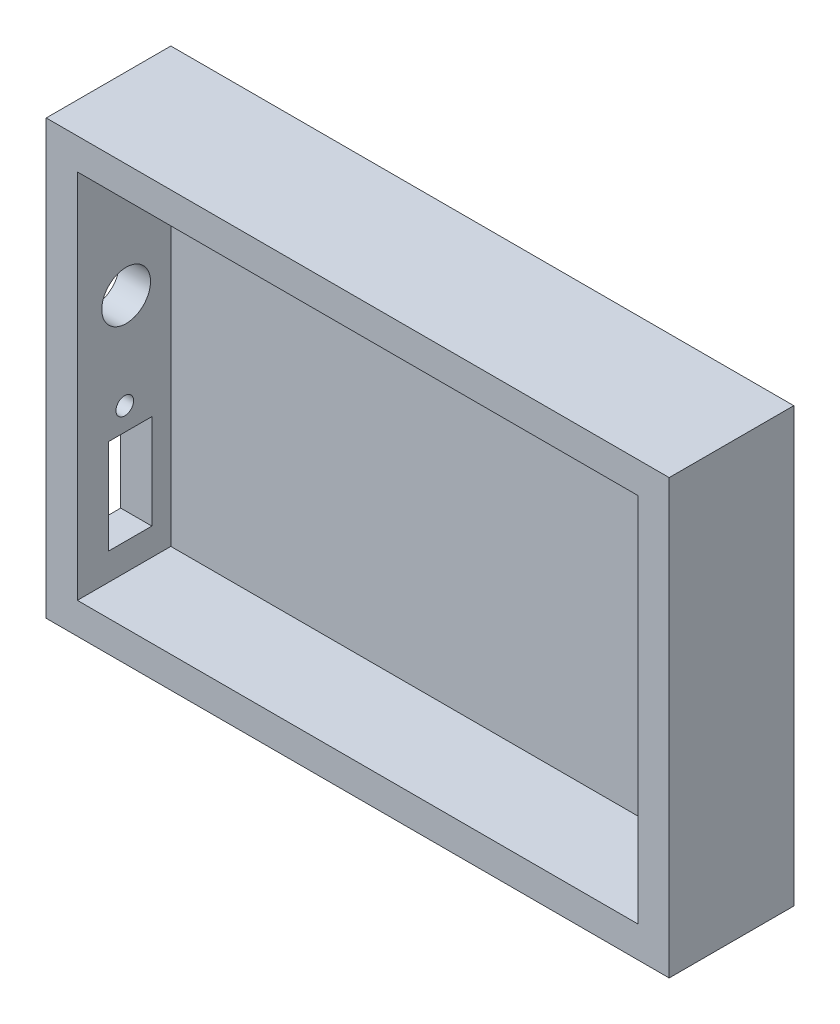
ISO-10303-21;
HEADER;
FILE_DESCRIPTION(('STEP AP214'),'2;1');
FILE_NAME('part.step','',(''),(''),'','','');
FILE_SCHEMA(('AUTOMOTIVE_DESIGN { 1 0 10303 214 1 1 1 1 }'));
ENDSEC;
DATA;
#1=APPLICATION_CONTEXT('core data for automotive mechanical design processes');
#2=APPLICATION_PROTOCOL_DEFINITION('international standard','automotive_design',2000,#1);
#3=PRODUCT_CONTEXT('',#1,'mechanical');
#4=PRODUCT('Part','Part','',(#3));
#5=PRODUCT_RELATED_PRODUCT_CATEGORY('part','',(#4));
#6=PRODUCT_DEFINITION_FORMATION('','',#4);
#7=PRODUCT_DEFINITION_CONTEXT('part definition',#1,'design');
#8=PRODUCT_DEFINITION('design','',#6,#7);
#9=PRODUCT_DEFINITION_SHAPE('','',#8);
#10=(LENGTH_UNIT() NAMED_UNIT(*) SI_UNIT(.MILLI.,.METRE.));
#11=(NAMED_UNIT(*) PLANE_ANGLE_UNIT() SI_UNIT($,.RADIAN.));
#12=(NAMED_UNIT(*) SI_UNIT($,.STERADIAN.) SOLID_ANGLE_UNIT());
#13=UNCERTAINTY_MEASURE_WITH_UNIT(LENGTH_MEASURE(1.E-05),#10,'distance_accuracy_value','');
#14=(GEOMETRIC_REPRESENTATION_CONTEXT(3) GLOBAL_UNCERTAINTY_ASSIGNED_CONTEXT((#13)) GLOBAL_UNIT_ASSIGNED_CONTEXT((#10,
#11,#12)) REPRESENTATION_CONTEXT('',''));
#15=CARTESIAN_POINT('',(0.,0.,0.));
#16=DIRECTION('',(0.,0.,1.));
#17=DIRECTION('',(1.,0.,0.));
#18=AXIS2_PLACEMENT_3D('',#15,#16,#17);
#19=CARTESIAN_POINT('',(115.,80.,46.));
#20=DIRECTION('',(-1.,0.,0.));
#21=DIRECTION('',(0.,-1.,0.));
#22=AXIS2_PLACEMENT_3D('',#19,#20,#21);
#23=PLANE('',#22);
#24=DIRECTION('',(0.,1.,0.));
#25=VECTOR('',#24,1.);
#26=CARTESIAN_POINT('',(115.,80.,0.));
#27=LINE('',#26,#25);
#28=CARTESIAN_POINT('',(115.,-80.,0.));
#29=VERTEX_POINT('',#28);
#30=CARTESIAN_POINT('',(115.,80.,0.));
#31=VERTEX_POINT('',#30);
#32=EDGE_CURVE('E165',#29,#31,#27,.T.);
#33=ORIENTED_EDGE('',*,*,#32,.T.);
#34=DIRECTION('',(0.,0.,-1.));
#35=VECTOR('',#34,1.);
#36=CARTESIAN_POINT('',(115.,80.,46.));
#37=LINE('',#36,#35);
#38=CARTESIAN_POINT('',(115.,80.,46.));
#39=VERTEX_POINT('',#38);
#40=EDGE_CURVE('E11',#39,#31,#37,.T.);
#41=ORIENTED_EDGE('',*,*,#40,.F.);
#42=DIRECTION('',(0.,1.,0.));
#43=VECTOR('',#42,1.);
#44=CARTESIAN_POINT('',(115.,80.,46.));
#45=LINE('',#44,#43);
#46=CARTESIAN_POINT('',(115.,-80.,46.));
#47=VERTEX_POINT('',#46);
#48=EDGE_CURVE('E189',#47,#39,#45,.T.);
#49=ORIENTED_EDGE('',*,*,#48,.F.);
#50=DIRECTION('',(0.,0.,-1.));
#51=VECTOR('',#50,1.);
#52=CARTESIAN_POINT('',(115.,-80.,46.));
#53=LINE('',#52,#51);
#54=EDGE_CURVE('E199',#47,#29,#53,.T.);
#55=ORIENTED_EDGE('',*,*,#54,.T.);
#56=EDGE_LOOP('',(#33,#41,#49,#55));
#57=FACE_BOUND('',#56,.T.);
#58=ADVANCED_FACE('F33',(#57),#23,.F.);
#59=CARTESIAN_POINT('',(-115.,80.,46.));
#60=DIRECTION('',(0.,-1.,0.));
#61=DIRECTION('',(0.,0.,-1.));
#62=AXIS2_PLACEMENT_3D('',#59,#60,#61);
#63=PLANE('',#62);
#64=DIRECTION('',(-1.,0.,0.));
#65=VECTOR('',#64,1.);
#66=CARTESIAN_POINT('',(-115.,80.,0.));
#67=LINE('',#66,#65);
#68=CARTESIAN_POINT('',(-115.,80.,0.));
#69=VERTEX_POINT('',#68);
#70=EDGE_CURVE('E202',#31,#69,#67,.T.);
#71=ORIENTED_EDGE('',*,*,#70,.T.);
#72=DIRECTION('',(0.,0.,-1.));
#73=VECTOR('',#72,1.);
#74=CARTESIAN_POINT('',(-115.,80.,46.));
#75=LINE('',#74,#73);
#76=CARTESIAN_POINT('',(-115.,80.,46.));
#77=VERTEX_POINT('',#76);
#78=EDGE_CURVE('E40',#77,#69,#75,.T.);
#79=ORIENTED_EDGE('',*,*,#78,.F.);
#80=DIRECTION('',(-1.,0.,0.));
#81=VECTOR('',#80,1.);
#82=CARTESIAN_POINT('',(-115.,80.,46.));
#83=LINE('',#82,#81);
#84=EDGE_CURVE('E192',#39,#77,#83,.T.);
#85=ORIENTED_EDGE('',*,*,#84,.F.);
#86=ORIENTED_EDGE('',*,*,#40,.T.);
#87=EDGE_LOOP('',(#71,#79,#85,#86));
#88=FACE_BOUND('',#87,.T.);
#89=ADVANCED_FACE('F232',(#88),#63,.F.);
#90=CARTESIAN_POINT('',(-115.,80.,46.));
#91=DIRECTION('',(1.,0.,0.));
#92=DIRECTION('',(0.,1.,0.));
#93=AXIS2_PLACEMENT_3D('',#90,#91,#92);
#94=PLANE('',#93);
#95=CARTESIAN_POINT('',(-115.,-15.,28.5));
#96=DIRECTION('',(-1.,0.,0.));
#97=DIRECTION('',(0.,-1.,0.));
#98=AXIS2_PLACEMENT_3D('',#95,#96,#97);
#99=CIRCLE('',#98,3.25);
#100=CARTESIAN_POINT('',(-115.,-18.25,28.5));
#101=VERTEX_POINT('',#100);
#102=EDGE_CURVE('E289',#101,#101,#99,.T.);
#103=ORIENTED_EDGE('',*,*,#102,.F.);
#104=EDGE_LOOP('',(#103));
#105=FACE_BOUND('',#104,.T.);
#106=CARTESIAN_POINT('',(-115.,20.,28.));
#107=DIRECTION('',(-1.,0.,0.));
#108=DIRECTION('',(0.,-1.,0.));
#109=AXIS2_PLACEMENT_3D('',#106,#107,#108);
#110=CIRCLE('',#109,9.00000000000001);
#111=CARTESIAN_POINT('',(-115.,11.,28.));
#112=VERTEX_POINT('',#111);
#113=EDGE_CURVE('E297',#112,#112,#110,.T.);
#114=ORIENTED_EDGE('',*,*,#113,.F.);
#115=EDGE_LOOP('',(#114));
#116=FACE_BOUND('',#115,.T.);
#117=DIRECTION('',(0.,1.,0.));
#118=VECTOR('',#117,1.);
#119=CARTESIAN_POINT('',(-115.,-23.5,34.5));
#120=LINE('',#119,#118);
#121=CARTESIAN_POINT('',(-115.,-58.5,34.5));
#122=VERTEX_POINT('',#121);
#123=CARTESIAN_POINT('',(-115.,-23.5,34.5));
#124=VERTEX_POINT('',#123);
#125=EDGE_CURVE('E145',#122,#124,#120,.T.);
#126=ORIENTED_EDGE('',*,*,#125,.F.);
#127=DIRECTION('',(0.,0.,1.));
#128=VECTOR('',#127,1.);
#129=CARTESIAN_POINT('',(-115.,-58.5,34.5));
#130=LINE('',#129,#128);
#131=CARTESIAN_POINT('',(-115.,-58.5,18.5));
#132=VERTEX_POINT('',#131);
#133=EDGE_CURVE('E138',#132,#122,#130,.T.);
#134=ORIENTED_EDGE('',*,*,#133,.F.);
#135=DIRECTION('',(0.,-1.,0.));
#136=VECTOR('',#135,1.);
#137=CARTESIAN_POINT('',(-115.,-23.5,18.5));
#138=LINE('',#137,#136);
#139=CARTESIAN_POINT('',(-115.,-23.5,18.5));
#140=VERTEX_POINT('',#139);
#141=EDGE_CURVE('E149',#140,#132,#138,.T.);
#142=ORIENTED_EDGE('',*,*,#141,.F.);
#143=DIRECTION('',(0.,0.,-1.));
#144=VECTOR('',#143,1.);
#145=CARTESIAN_POINT('',(-115.,-23.5,34.5));
#146=LINE('',#145,#144);
#147=EDGE_CURVE('E47',#124,#140,#146,.T.);
#148=ORIENTED_EDGE('',*,*,#147,.F.);
#149=EDGE_LOOP('',(#126,#134,#142,#148));
#150=FACE_BOUND('',#149,.T.);
#151=DIRECTION('',(0.,-1.,0.));
#152=VECTOR('',#151,1.);
#153=CARTESIAN_POINT('',(-115.,80.,0.));
#154=LINE('',#153,#152);
#155=CARTESIAN_POINT('',(-115.,-80.,0.));
#156=VERTEX_POINT('',#155);
#157=EDGE_CURVE('E204',#69,#156,#154,.T.);
#158=ORIENTED_EDGE('',*,*,#157,.T.);
#159=DIRECTION('',(0.,0.,-1.));
#160=VECTOR('',#159,1.);
#161=CARTESIAN_POINT('',(-115.,-80.,46.));
#162=LINE('',#161,#160);
#163=CARTESIAN_POINT('',(-115.,-80.,46.));
#164=VERTEX_POINT('',#163);
#165=EDGE_CURVE('E209',#164,#156,#162,.T.);
#166=ORIENTED_EDGE('',*,*,#165,.F.);
#167=DIRECTION('',(0.,-1.,0.));
#168=VECTOR('',#167,1.);
#169=CARTESIAN_POINT('',(-115.,80.,46.));
#170=LINE('',#169,#168);
#171=EDGE_CURVE('E195',#77,#164,#170,.T.);
#172=ORIENTED_EDGE('',*,*,#171,.F.);
#173=ORIENTED_EDGE('',*,*,#78,.T.);
#174=EDGE_LOOP('',(#158,#166,#172,#173));
#175=FACE_BOUND('',#174,.T.);
#176=ADVANCED_FACE('F216',(#105,#116,#150,#175),#94,.F.);
#177=CARTESIAN_POINT('',(-115.,-80.,46.));
#178=DIRECTION('',(0.,1.,0.));
#179=DIRECTION('',(0.,0.,1.));
#180=AXIS2_PLACEMENT_3D('',#177,#178,#179);
#181=PLANE('',#180);
#182=DIRECTION('',(1.,0.,0.));
#183=VECTOR('',#182,1.);
#184=CARTESIAN_POINT('',(-115.,-80.,0.));
#185=LINE('',#184,#183);
#186=EDGE_CURVE('E193',#156,#29,#185,.T.);
#187=ORIENTED_EDGE('',*,*,#186,.T.);
#188=ORIENTED_EDGE('',*,*,#54,.F.);
#189=DIRECTION('',(1.,0.,0.));
#190=VECTOR('',#189,1.);
#191=CARTESIAN_POINT('',(-115.,-80.,46.));
#192=LINE('',#191,#190);
#193=EDGE_CURVE('E197',#164,#47,#192,.T.);
#194=ORIENTED_EDGE('',*,*,#193,.F.);
#195=ORIENTED_EDGE('',*,*,#165,.T.);
#196=EDGE_LOOP('',(#187,#188,#194,#195));
#197=FACE_BOUND('',#196,.T.);
#198=ADVANCED_FACE('F225',(#197),#181,.F.);
#199=CARTESIAN_POINT('',(0.,0.,46.));
#200=DIRECTION('',(0.,0.,1.));
#201=DIRECTION('',(1.,0.,0.));
#202=AXIS2_PLACEMENT_3D('',#199,#200,#201);
#203=PLANE('',#202);
#204=DIRECTION('',(0.,1.,0.));
#205=VECTOR('',#204,1.);
#206=CARTESIAN_POINT('',(103.5,80.,46.));
#207=LINE('',#206,#205);
#208=CARTESIAN_POINT('',(103.5,-68.5,46.));
#209=VERTEX_POINT('',#208);
#210=CARTESIAN_POINT('',(103.5,68.5,46.));
#211=VERTEX_POINT('',#210);
#212=EDGE_CURVE('E181',#209,#211,#207,.T.);
#213=ORIENTED_EDGE('',*,*,#212,.F.);
#214=DIRECTION('',(1.,0.,0.));
#215=VECTOR('',#214,1.);
#216=CARTESIAN_POINT('',(-115.,-68.5,46.));
#217=LINE('',#216,#215);
#218=CARTESIAN_POINT('',(-103.5,-68.5,46.));
#219=VERTEX_POINT('',#218);
#220=EDGE_CURVE('E171',#219,#209,#217,.T.);
#221=ORIENTED_EDGE('',*,*,#220,.F.);
#222=DIRECTION('',(0.,-1.,0.));
#223=VECTOR('',#222,1.);
#224=CARTESIAN_POINT('',(-103.5,80.,46.));
#225=LINE('',#224,#223);
#226=CARTESIAN_POINT('',(-103.5,68.5,46.));
#227=VERTEX_POINT('',#226);
#228=EDGE_CURVE('E185',#227,#219,#225,.T.);
#229=ORIENTED_EDGE('',*,*,#228,.F.);
#230=DIRECTION('',(-1.,0.,0.));
#231=VECTOR('',#230,1.);
#232=CARTESIAN_POINT('',(-115.,68.5,46.));
#233=LINE('',#232,#231);
#234=EDGE_CURVE('E183',#211,#227,#233,.T.);
#235=ORIENTED_EDGE('',*,*,#234,.F.);
#236=EDGE_LOOP('',(#213,#221,#229,#235));
#237=FACE_BOUND('',#236,.T.);
#238=ORIENTED_EDGE('',*,*,#48,.T.);
#239=ORIENTED_EDGE('',*,*,#84,.T.);
#240=ORIENTED_EDGE('',*,*,#171,.T.);
#241=ORIENTED_EDGE('',*,*,#193,.T.);
#242=EDGE_LOOP('',(#238,#239,#240,#241));
#243=FACE_BOUND('',#242,.T.);
#244=ADVANCED_FACE('F231',(#237,#243),#203,.T.);
#245=CARTESIAN_POINT('',(0.,0.,0.));
#246=DIRECTION('',(0.,0.,1.));
#247=DIRECTION('',(1.,0.,0.));
#248=AXIS2_PLACEMENT_3D('',#245,#246,#247);
#249=PLANE('',#248);
#250=ORIENTED_EDGE('',*,*,#32,.F.);
#251=ORIENTED_EDGE('',*,*,#186,.F.);
#252=ORIENTED_EDGE('',*,*,#157,.F.);
#253=ORIENTED_EDGE('',*,*,#70,.F.);
#254=EDGE_LOOP('',(#250,#251,#252,#253));
#255=FACE_BOUND('',#254,.T.);
#256=ADVANCED_FACE('F222',(#255),#249,.F.);
#257=CARTESIAN_POINT('',(103.5,80.,46.));
#258=DIRECTION('',(-1.,0.,0.));
#259=DIRECTION('',(0.,-1.,0.));
#260=AXIS2_PLACEMENT_3D('',#257,#258,#259);
#261=PLANE('',#260);
#262=DIRECTION('',(0.,1.,0.));
#263=VECTOR('',#262,1.);
#264=CARTESIAN_POINT('',(103.5,80.,11.5));
#265=LINE('',#264,#263);
#266=CARTESIAN_POINT('',(103.5,-68.5,11.5));
#267=VERTEX_POINT('',#266);
#268=CARTESIAN_POINT('',(103.5,68.5,11.5));
#269=VERTEX_POINT('',#268);
#270=EDGE_CURVE('E158',#267,#269,#265,.T.);
#271=ORIENTED_EDGE('',*,*,#270,.F.);
#272=DIRECTION('',(0.,0.,-1.));
#273=VECTOR('',#272,1.);
#274=CARTESIAN_POINT('',(103.5,-68.5,46.));
#275=LINE('',#274,#273);
#276=EDGE_CURVE('E167',#209,#267,#275,.T.);
#277=ORIENTED_EDGE('',*,*,#276,.F.);
#278=ORIENTED_EDGE('',*,*,#212,.T.);
#279=DIRECTION('',(0.,0.,-1.));
#280=VECTOR('',#279,1.);
#281=CARTESIAN_POINT('',(103.5,68.5,46.));
#282=LINE('',#281,#280);
#283=EDGE_CURVE('E162',#211,#269,#282,.T.);
#284=ORIENTED_EDGE('',*,*,#283,.T.);
#285=EDGE_LOOP('',(#271,#277,#278,#284));
#286=FACE_BOUND('',#285,.T.);
#287=ADVANCED_FACE('F245',(#286),#261,.T.);
#288=CARTESIAN_POINT('',(-115.,68.5,46.));
#289=DIRECTION('',(0.,-1.,0.));
#290=DIRECTION('',(0.,0.,-1.));
#291=AXIS2_PLACEMENT_3D('',#288,#289,#290);
#292=PLANE('',#291);
#293=DIRECTION('',(-1.,0.,0.));
#294=VECTOR('',#293,1.);
#295=CARTESIAN_POINT('',(-115.,68.5,11.5));
#296=LINE('',#295,#294);
#297=CARTESIAN_POINT('',(-103.5,68.5,11.5));
#298=VERTEX_POINT('',#297);
#299=EDGE_CURVE('E161',#269,#298,#296,.T.);
#300=ORIENTED_EDGE('',*,*,#299,.F.);
#301=ORIENTED_EDGE('',*,*,#283,.F.);
#302=ORIENTED_EDGE('',*,*,#234,.T.);
#303=DIRECTION('',(0.,0.,-1.));
#304=VECTOR('',#303,1.);
#305=CARTESIAN_POINT('',(-103.5,68.5,46.));
#306=LINE('',#305,#304);
#307=EDGE_CURVE('E166',#227,#298,#306,.T.);
#308=ORIENTED_EDGE('',*,*,#307,.T.);
#309=EDGE_LOOP('',(#300,#301,#302,#308));
#310=FACE_BOUND('',#309,.T.);
#311=ADVANCED_FACE('F259',(#310),#292,.T.);
#312=CARTESIAN_POINT('',(-103.5,80.,46.));
#313=DIRECTION('',(1.,0.,0.));
#314=DIRECTION('',(0.,1.,0.));
#315=AXIS2_PLACEMENT_3D('',#312,#313,#314);
#316=PLANE('',#315);
#317=CARTESIAN_POINT('',(-103.5,-15.,28.5));
#318=DIRECTION('',(1.,0.,0.));
#319=DIRECTION('',(0.,1.,0.));
#320=AXIS2_PLACEMENT_3D('',#317,#318,#319);
#321=CIRCLE('',#320,3.25);
#322=CARTESIAN_POINT('',(-103.5,-11.75,28.5));
#323=VERTEX_POINT('',#322);
#324=EDGE_CURVE('E292',#323,#323,#321,.F.);
#325=ORIENTED_EDGE('',*,*,#324,.T.);
#326=EDGE_LOOP('',(#325));
#327=FACE_BOUND('',#326,.T.);
#328=CARTESIAN_POINT('',(-103.5,20.,28.));
#329=DIRECTION('',(1.,0.,0.));
#330=DIRECTION('',(0.,1.,0.));
#331=AXIS2_PLACEMENT_3D('',#328,#329,#330);
#332=CIRCLE('',#331,9.00000000000001);
#333=CARTESIAN_POINT('',(-103.5,29.,28.));
#334=VERTEX_POINT('',#333);
#335=EDGE_CURVE('E294',#334,#334,#332,.F.);
#336=ORIENTED_EDGE('',*,*,#335,.T.);
#337=EDGE_LOOP('',(#336));
#338=FACE_BOUND('',#337,.T.);
#339=DIRECTION('',(0.,0.,1.));
#340=VECTOR('',#339,1.);
#341=CARTESIAN_POINT('',(-103.5,-58.5,34.5));
#342=LINE('',#341,#340);
#343=CARTESIAN_POINT('',(-103.5,-58.5,18.5));
#344=VERTEX_POINT('',#343);
#345=CARTESIAN_POINT('',(-103.5,-58.5,34.5));
#346=VERTEX_POINT('',#345);
#347=EDGE_CURVE('E135',#344,#346,#342,.T.);
#348=ORIENTED_EDGE('',*,*,#347,.T.);
#349=DIRECTION('',(0.,1.,0.));
#350=VECTOR('',#349,1.);
#351=CARTESIAN_POINT('',(-103.5,-23.5,34.5));
#352=LINE('',#351,#350);
#353=CARTESIAN_POINT('',(-103.5,-23.5,34.5));
#354=VERTEX_POINT('',#353);
#355=EDGE_CURVE('E122',#346,#354,#352,.T.);
#356=ORIENTED_EDGE('',*,*,#355,.T.);
#357=DIRECTION('',(0.,0.,-1.));
#358=VECTOR('',#357,1.);
#359=CARTESIAN_POINT('',(-103.5,-23.5,34.5));
#360=LINE('',#359,#358);
#361=CARTESIAN_POINT('',(-103.5,-23.5,18.5));
#362=VERTEX_POINT('',#361);
#363=EDGE_CURVE('E153',#354,#362,#360,.T.);
#364=ORIENTED_EDGE('',*,*,#363,.T.);
#365=DIRECTION('',(0.,-1.,0.));
#366=VECTOR('',#365,1.);
#367=CARTESIAN_POINT('',(-103.5,-23.5,18.5));
#368=LINE('',#367,#366);
#369=EDGE_CURVE('E143',#362,#344,#368,.T.);
#370=ORIENTED_EDGE('',*,*,#369,.T.);
#371=EDGE_LOOP('',(#348,#356,#364,#370));
#372=FACE_BOUND('',#371,.T.);
#373=DIRECTION('',(0.,-1.,0.));
#374=VECTOR('',#373,1.);
#375=CARTESIAN_POINT('',(-103.5,80.,11.5));
#376=LINE('',#375,#374);
#377=CARTESIAN_POINT('',(-103.5,-68.5,11.5));
#378=VERTEX_POINT('',#377);
#379=EDGE_CURVE('E173',#298,#378,#376,.T.);
#380=ORIENTED_EDGE('',*,*,#379,.F.);
#381=ORIENTED_EDGE('',*,*,#307,.F.);
#382=ORIENTED_EDGE('',*,*,#228,.T.);
#383=DIRECTION('',(0.,0.,-1.));
#384=VECTOR('',#383,1.);
#385=CARTESIAN_POINT('',(-103.5,-68.5,46.));
#386=LINE('',#385,#384);
#387=EDGE_CURVE('E170',#219,#378,#386,.T.);
#388=ORIENTED_EDGE('',*,*,#387,.T.);
#389=EDGE_LOOP('',(#380,#381,#382,#388));
#390=FACE_BOUND('',#389,.T.);
#391=ADVANCED_FACE('F141',(#327,#338,#372,#390),#316,.T.);
#392=CARTESIAN_POINT('',(-115.,-68.5,46.));
#393=DIRECTION('',(0.,1.,0.));
#394=DIRECTION('',(0.,0.,1.));
#395=AXIS2_PLACEMENT_3D('',#392,#393,#394);
#396=PLANE('',#395);
#397=DIRECTION('',(1.,0.,0.));
#398=VECTOR('',#397,1.);
#399=CARTESIAN_POINT('',(-115.,-68.5,11.5));
#400=LINE('',#399,#398);
#401=EDGE_CURVE('E177',#378,#267,#400,.T.);
#402=ORIENTED_EDGE('',*,*,#401,.F.);
#403=ORIENTED_EDGE('',*,*,#387,.F.);
#404=ORIENTED_EDGE('',*,*,#220,.T.);
#405=ORIENTED_EDGE('',*,*,#276,.T.);
#406=EDGE_LOOP('',(#402,#403,#404,#405));
#407=FACE_BOUND('',#406,.T.);
#408=ADVANCED_FACE('F252',(#407),#396,.T.);
#409=CARTESIAN_POINT('',(0.,0.,11.5));
#410=DIRECTION('',(0.,0.,1.));
#411=DIRECTION('',(1.,0.,0.));
#412=AXIS2_PLACEMENT_3D('',#409,#410,#411);
#413=PLANE('',#412);
#414=ORIENTED_EDGE('',*,*,#270,.T.);
#415=ORIENTED_EDGE('',*,*,#299,.T.);
#416=ORIENTED_EDGE('',*,*,#379,.T.);
#417=ORIENTED_EDGE('',*,*,#401,.T.);
#418=EDGE_LOOP('',(#414,#415,#416,#417));
#419=FACE_BOUND('',#418,.T.);
#420=ADVANCED_FACE('F249',(#419),#413,.T.);
#421=CARTESIAN_POINT('',(-65.0162371902123,-58.5,34.5));
#422=DIRECTION('',(0.,-1.,0.));
#423=DIRECTION('',(0.,0.,-1.));
#424=AXIS2_PLACEMENT_3D('',#421,#422,#423);
#425=PLANE('',#424);
#426=DIRECTION('',(-1.,0.,0.));
#427=VECTOR('',#426,1.);
#428=CARTESIAN_POINT('',(-65.0162371902123,-58.5,18.5));
#429=LINE('',#428,#427);
#430=EDGE_CURVE('E55',#344,#132,#429,.T.);
#431=ORIENTED_EDGE('',*,*,#430,.T.);
#432=ORIENTED_EDGE('',*,*,#133,.T.);
#433=DIRECTION('',(-1.,0.,0.));
#434=VECTOR('',#433,1.);
#435=CARTESIAN_POINT('',(-65.0162371902123,-58.5,34.5));
#436=LINE('',#435,#434);
#437=EDGE_CURVE('E126',#346,#122,#436,.T.);
#438=ORIENTED_EDGE('',*,*,#437,.F.);
#439=ORIENTED_EDGE('',*,*,#347,.F.);
#440=EDGE_LOOP('',(#431,#432,#438,#439));
#441=FACE_BOUND('',#440,.T.);
#442=ADVANCED_FACE('F134',(#441),#425,.F.);
#443=CARTESIAN_POINT('',(-65.0162371902123,-23.5,34.5));
#444=DIRECTION('',(0.,0.,1.));
#445=DIRECTION('',(0.,-1.,0.));
#446=AXIS2_PLACEMENT_3D('',#443,#444,#445);
#447=PLANE('',#446);
#448=ORIENTED_EDGE('',*,*,#437,.T.);
#449=ORIENTED_EDGE('',*,*,#125,.T.);
#450=DIRECTION('',(-1.,0.,0.));
#451=VECTOR('',#450,1.);
#452=CARTESIAN_POINT('',(-65.0162371902123,-23.5,34.5));
#453=LINE('',#452,#451);
#454=EDGE_CURVE('E128',#354,#124,#453,.T.);
#455=ORIENTED_EDGE('',*,*,#454,.F.);
#456=ORIENTED_EDGE('',*,*,#355,.F.);
#457=EDGE_LOOP('',(#448,#449,#455,#456));
#458=FACE_BOUND('',#457,.T.);
#459=ADVANCED_FACE('F124',(#458),#447,.F.);
#460=CARTESIAN_POINT('',(-65.0162371902123,-23.5,34.5));
#461=DIRECTION('',(0.,1.,0.));
#462=DIRECTION('',(0.,0.,1.));
#463=AXIS2_PLACEMENT_3D('',#460,#461,#462);
#464=PLANE('',#463);
#465=ORIENTED_EDGE('',*,*,#454,.T.);
#466=ORIENTED_EDGE('',*,*,#147,.T.);
#467=DIRECTION('',(-1.,0.,0.));
#468=VECTOR('',#467,1.);
#469=CARTESIAN_POINT('',(-65.0162371902123,-23.5,18.5));
#470=LINE('',#469,#468);
#471=EDGE_CURVE('E152',#362,#140,#470,.T.);
#472=ORIENTED_EDGE('',*,*,#471,.F.);
#473=ORIENTED_EDGE('',*,*,#363,.F.);
#474=EDGE_LOOP('',(#465,#466,#472,#473));
#475=FACE_BOUND('',#474,.T.);
#476=ADVANCED_FACE('F271',(#475),#464,.F.);
#477=CARTESIAN_POINT('',(-65.0162371902123,-23.5,18.5));
#478=DIRECTION('',(0.,0.,-1.));
#479=DIRECTION('',(0.,1.,0.));
#480=AXIS2_PLACEMENT_3D('',#477,#478,#479);
#481=PLANE('',#480);
#482=ORIENTED_EDGE('',*,*,#471,.T.);
#483=ORIENTED_EDGE('',*,*,#141,.T.);
#484=ORIENTED_EDGE('',*,*,#430,.F.);
#485=ORIENTED_EDGE('',*,*,#369,.F.);
#486=EDGE_LOOP('',(#482,#483,#484,#485));
#487=FACE_BOUND('',#486,.T.);
#488=ADVANCED_FACE('F274',(#487),#481,.F.);
#489=CARTESIAN_POINT('',(-65.0162371902123,20.,28.));
#490=DIRECTION('',(-1.,0.,0.));
#491=DIRECTION('',(0.,-1.,0.));
#492=AXIS2_PLACEMENT_3D('',#489,#490,#491);
#493=CYLINDRICAL_SURFACE('',#492,9.00000000000001);
#494=ORIENTED_EDGE('',*,*,#113,.T.);
#495=EDGE_LOOP('',(#494));
#496=FACE_BOUND('',#495,.T.);
#497=ORIENTED_EDGE('',*,*,#335,.F.);
#498=EDGE_LOOP('',(#497));
#499=FACE_BOUND('',#498,.T.);
#500=ADVANCED_FACE('F277',(#496,#499),#493,.F.);
#501=CARTESIAN_POINT('',(-65.0162371902123,-15.,28.5));
#502=DIRECTION('',(-1.,0.,0.));
#503=DIRECTION('',(0.,-1.,0.));
#504=AXIS2_PLACEMENT_3D('',#501,#502,#503);
#505=CYLINDRICAL_SURFACE('',#504,3.25);
#506=ORIENTED_EDGE('',*,*,#102,.T.);
#507=EDGE_LOOP('',(#506));
#508=FACE_BOUND('',#507,.T.);
#509=ORIENTED_EDGE('',*,*,#324,.F.);
#510=EDGE_LOOP('',(#509));
#511=FACE_BOUND('',#510,.T.);
#512=ADVANCED_FACE('F280',(#508,#511),#505,.F.);
#513=CLOSED_SHELL('',(#58,#89,#176,#198,#244,#256,#287,#311,#391,#408,#420,#442,#459,#476,#488,
#500,#512));
#514=MANIFOLD_SOLID_BREP('B2',#513);
#515=ADVANCED_BREP_SHAPE_REPRESENTATION('',(#18,#514),#14);
#516=SHAPE_DEFINITION_REPRESENTATION(#9,#515);
ENDSEC;
END-ISO-10303-21;
